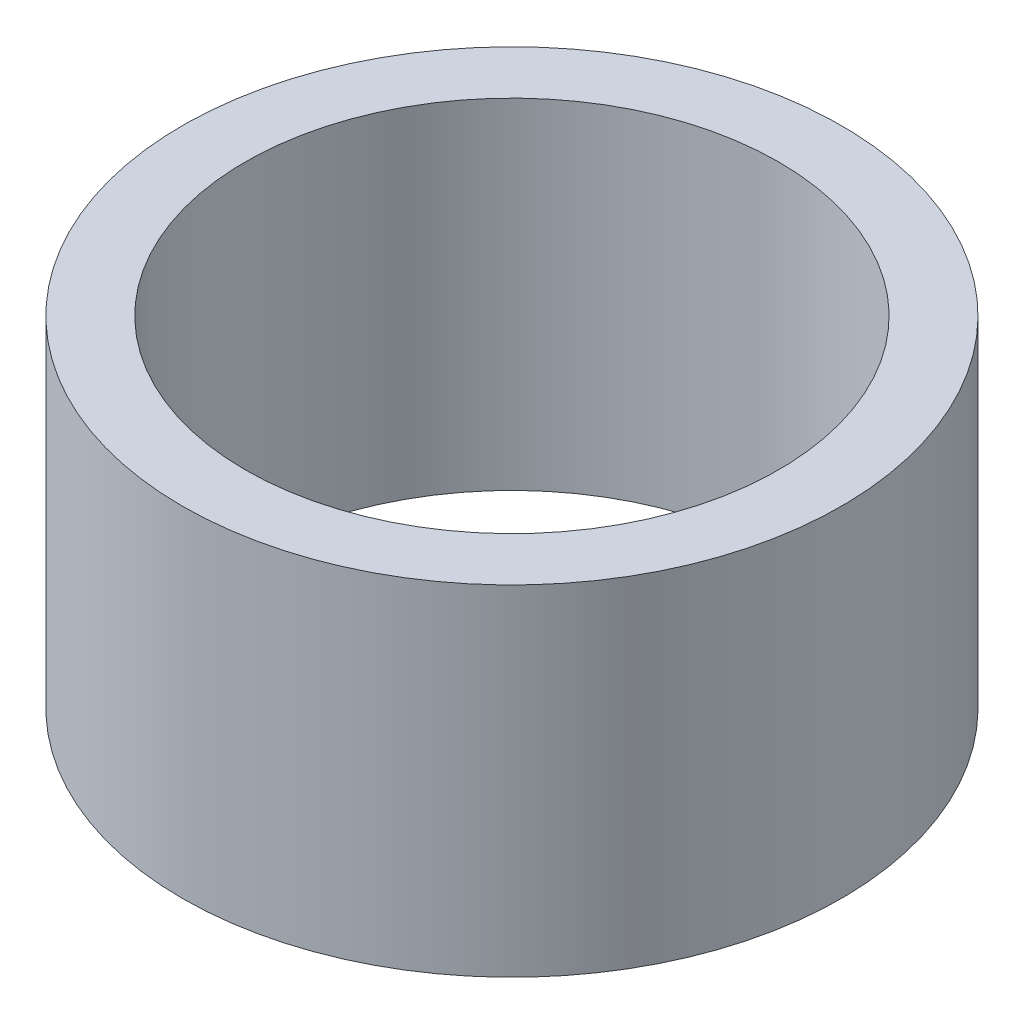
ISO-10303-21;
HEADER;
FILE_DESCRIPTION(('STEP AP214'),'2;1');
FILE_NAME('part.step','',(''),(''),'','','');
FILE_SCHEMA(('AUTOMOTIVE_DESIGN { 1 0 10303 214 1 1 1 1 }'));
ENDSEC;
DATA;
#1=APPLICATION_CONTEXT('core data for automotive mechanical design processes');
#2=APPLICATION_PROTOCOL_DEFINITION('international standard','automotive_design',2000,#1);
#3=PRODUCT_CONTEXT('',#1,'mechanical');
#4=PRODUCT('Part','Part','',(#3));
#5=PRODUCT_RELATED_PRODUCT_CATEGORY('part','',(#4));
#6=PRODUCT_DEFINITION_FORMATION('','',#4);
#7=PRODUCT_DEFINITION_CONTEXT('part definition',#1,'design');
#8=PRODUCT_DEFINITION('design','',#6,#7);
#9=PRODUCT_DEFINITION_SHAPE('','',#8);
#10=(LENGTH_UNIT() NAMED_UNIT(*) SI_UNIT(.MILLI.,.METRE.));
#11=(NAMED_UNIT(*) PLANE_ANGLE_UNIT() SI_UNIT($,.RADIAN.));
#12=(NAMED_UNIT(*) SI_UNIT($,.STERADIAN.) SOLID_ANGLE_UNIT());
#13=UNCERTAINTY_MEASURE_WITH_UNIT(LENGTH_MEASURE(1.E-05),#10,'distance_accuracy_value','');
#14=(GEOMETRIC_REPRESENTATION_CONTEXT(3) GLOBAL_UNCERTAINTY_ASSIGNED_CONTEXT((#13)) GLOBAL_UNIT_ASSIGNED_CONTEXT((#10,
#11,#12)) REPRESENTATION_CONTEXT('',''));
#15=CARTESIAN_POINT('',(0.,0.,0.));
#16=DIRECTION('',(0.,0.,1.));
#17=DIRECTION('',(1.,0.,0.));
#18=AXIS2_PLACEMENT_3D('',#15,#16,#17);
#19=CARTESIAN_POINT('',(0.,5.,0.));
#20=DIRECTION('',(0.,1.,0.));
#21=DIRECTION('',(0.,0.,1.));
#22=AXIS2_PLACEMENT_3D('',#19,#20,#21);
#23=PLANE('',#22);
#24=CARTESIAN_POINT('',(0.,5.,0.));
#25=DIRECTION('',(0.,1.,0.));
#26=DIRECTION('',(0.,0.,1.));
#27=AXIS2_PLACEMENT_3D('',#24,#25,#26);
#28=CIRCLE('',#27,4.85);
#29=CARTESIAN_POINT('',(0.,5.,4.85));
#30=VERTEX_POINT('',#29);
#31=EDGE_CURVE('E10',#30,#30,#28,.T.);
#32=ORIENTED_EDGE('',*,*,#31,.T.);
#33=EDGE_LOOP('',(#32));
#34=FACE_BOUND('',#33,.T.);
#35=CARTESIAN_POINT('',(0.,5.,0.));
#36=DIRECTION('',(0.,1.,0.));
#37=DIRECTION('',(0.,0.,1.));
#38=AXIS2_PLACEMENT_3D('',#35,#36,#37);
#39=CIRCLE('',#38,3.925);
#40=CARTESIAN_POINT('',(0.,5.,3.925));
#41=VERTEX_POINT('',#40);
#42=EDGE_CURVE('E50',#41,#41,#39,.T.);
#43=ORIENTED_EDGE('',*,*,#42,.F.);
#44=EDGE_LOOP('',(#43));
#45=FACE_BOUND('',#44,.T.);
#46=ADVANCED_FACE('F37',(#34,#45),#23,.T.);
#47=CARTESIAN_POINT('',(0.,0.,0.));
#48=DIRECTION('',(0.,1.,0.));
#49=DIRECTION('',(0.,0.,1.));
#50=AXIS2_PLACEMENT_3D('',#47,#48,#49);
#51=PLANE('',#50);
#52=CARTESIAN_POINT('',(0.,0.,0.));
#53=DIRECTION('',(0.,1.,0.));
#54=DIRECTION('',(0.,0.,1.));
#55=AXIS2_PLACEMENT_3D('',#52,#53,#54);
#56=CIRCLE('',#55,4.85);
#57=CARTESIAN_POINT('',(0.,0.,4.85));
#58=VERTEX_POINT('',#57);
#59=EDGE_CURVE('E41',#58,#58,#56,.T.);
#60=ORIENTED_EDGE('',*,*,#59,.F.);
#61=EDGE_LOOP('',(#60));
#62=FACE_BOUND('',#61,.T.);
#63=CARTESIAN_POINT('',(0.,0.,0.));
#64=DIRECTION('',(0.,1.,0.));
#65=DIRECTION('',(0.,0.,1.));
#66=AXIS2_PLACEMENT_3D('',#63,#64,#65);
#67=CIRCLE('',#66,3.925);
#68=CARTESIAN_POINT('',(0.,0.,3.925));
#69=VERTEX_POINT('',#68);
#70=EDGE_CURVE('E52',#69,#69,#67,.T.);
#71=ORIENTED_EDGE('',*,*,#70,.T.);
#72=EDGE_LOOP('',(#71));
#73=FACE_BOUND('',#72,.T.);
#74=ADVANCED_FACE('F64',(#62,#73),#51,.F.);
#75=CARTESIAN_POINT('',(0.,5.,0.));
#76=DIRECTION('',(0.,-1.,0.));
#77=DIRECTION('',(0.,0.,-1.));
#78=AXIS2_PLACEMENT_3D('',#75,#76,#77);
#79=CYLINDRICAL_SURFACE('',#78,4.85);
#80=ORIENTED_EDGE('',*,*,#31,.F.);
#81=EDGE_LOOP('',(#80));
#82=FACE_BOUND('',#81,.T.);
#83=ORIENTED_EDGE('',*,*,#59,.T.);
#84=EDGE_LOOP('',(#83));
#85=FACE_BOUND('',#84,.T.);
#86=ADVANCED_FACE('F39',(#82,#85),#79,.T.);
#87=CARTESIAN_POINT('',(0.,5.,0.));
#88=DIRECTION('',(0.,-1.,0.));
#89=DIRECTION('',(0.,0.,-1.));
#90=AXIS2_PLACEMENT_3D('',#87,#88,#89);
#91=CYLINDRICAL_SURFACE('',#90,3.925);
#92=ORIENTED_EDGE('',*,*,#42,.T.);
#93=EDGE_LOOP('',(#92));
#94=FACE_BOUND('',#93,.T.);
#95=ORIENTED_EDGE('',*,*,#70,.F.);
#96=EDGE_LOOP('',(#95));
#97=FACE_BOUND('',#96,.T.);
#98=ADVANCED_FACE('F60',(#94,#97),#91,.F.);
#99=CLOSED_SHELL('',(#46,#74,#86,#98));
#100=MANIFOLD_SOLID_BREP('B2',#99);
#101=ADVANCED_BREP_SHAPE_REPRESENTATION('',(#18,#100),#14);
#102=SHAPE_DEFINITION_REPRESENTATION(#9,#101);
ENDSEC;
END-ISO-10303-21;
